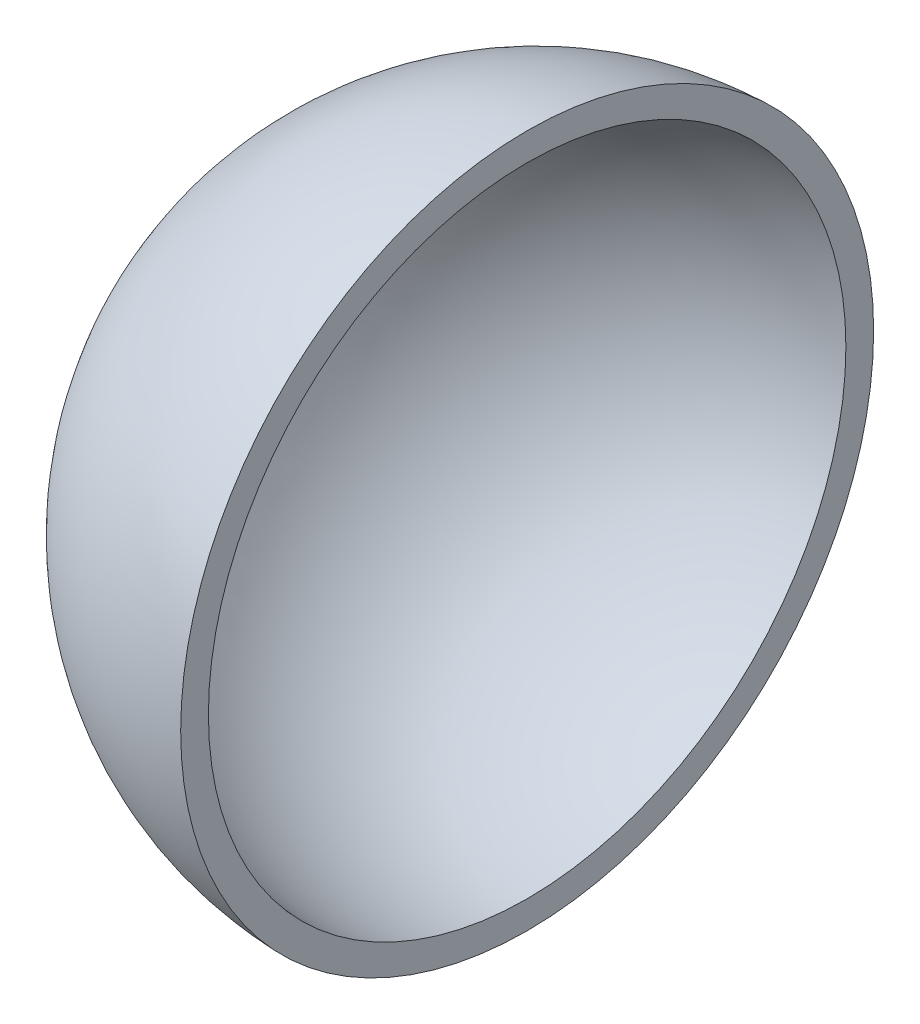
ISO-10303-21;
HEADER;
FILE_DESCRIPTION(('STEP AP214'),'2;1');
FILE_NAME('part.step','',(''),(''),'','','');
FILE_SCHEMA(('AUTOMOTIVE_DESIGN { 1 0 10303 214 1 1 1 1 }'));
ENDSEC;
DATA;
#1=APPLICATION_CONTEXT('core data for automotive mechanical design processes');
#2=APPLICATION_PROTOCOL_DEFINITION('international standard','automotive_design',2000,#1);
#3=PRODUCT_CONTEXT('',#1,'mechanical');
#4=PRODUCT('Part','Part','',(#3));
#5=PRODUCT_RELATED_PRODUCT_CATEGORY('part','',(#4));
#6=PRODUCT_DEFINITION_FORMATION('','',#4);
#7=PRODUCT_DEFINITION_CONTEXT('part definition',#1,'design');
#8=PRODUCT_DEFINITION('design','',#6,#7);
#9=PRODUCT_DEFINITION_SHAPE('','',#8);
#10=(LENGTH_UNIT() NAMED_UNIT(*) SI_UNIT(.MILLI.,.METRE.));
#11=(NAMED_UNIT(*) PLANE_ANGLE_UNIT() SI_UNIT($,.RADIAN.));
#12=(NAMED_UNIT(*) SI_UNIT($,.STERADIAN.) SOLID_ANGLE_UNIT());
#13=UNCERTAINTY_MEASURE_WITH_UNIT(LENGTH_MEASURE(1.E-05),#10,'distance_accuracy_value','');
#14=(GEOMETRIC_REPRESENTATION_CONTEXT(3) GLOBAL_UNCERTAINTY_ASSIGNED_CONTEXT((#13)) GLOBAL_UNIT_ASSIGNED_CONTEXT((#10,
#11,#12)) REPRESENTATION_CONTEXT('',''));
#15=CARTESIAN_POINT('',(0.,0.,0.));
#16=DIRECTION('',(0.,0.,1.));
#17=DIRECTION('',(1.,0.,0.));
#18=AXIS2_PLACEMENT_3D('',#15,#16,#17);
#19=CARTESIAN_POINT('',(0.,0.,0.));
#20=DIRECTION('',(1.,0.,0.));
#21=DIRECTION('',(0.,0.,1.));
#22=AXIS2_PLACEMENT_3D('',#19,#20,#21);
#23=SPHERICAL_SURFACE('',#22,37.5);
#24=CARTESIAN_POINT('',(-0.999999999999994,0.,0.));
#25=DIRECTION('',(1.,0.,0.));
#26=DIRECTION('',(0.,0.,-1.));
#27=AXIS2_PLACEMENT_3D('',#24,#25,#26);
#28=CIRCLE('',#27,37.4866642954531);
#29=CARTESIAN_POINT('',(-0.999999999999994,0.,-37.4866642954531));
#30=VERTEX_POINT('',#29);
#31=EDGE_CURVE('E10',#30,#30,#28,.T.);
#32=ORIENTED_EDGE('',*,*,#31,.F.);
#33=EDGE_LOOP('',(#32));
#34=FACE_BOUND('',#33,.T.);
#35=ADVANCED_FACE('F33',(#34),#23,.T.);
#36=CARTESIAN_POINT('',(-0.999999999999994,0.,34.4855042010408));
#37=DIRECTION('',(-1.,0.,0.));
#38=DIRECTION('',(0.,0.,1.));
#39=AXIS2_PLACEMENT_3D('',#36,#37,#38);
#40=PLANE('',#39);
#41=CARTESIAN_POINT('',(-0.999999999999995,0.,0.));
#42=DIRECTION('',(1.,0.,0.));
#43=DIRECTION('',(0.,0.,-1.));
#44=AXIS2_PLACEMENT_3D('',#41,#42,#43);
#45=CIRCLE('',#44,34.4855042010408);
#46=CARTESIAN_POINT('',(-0.999999999999995,0.,-34.4855042010408));
#47=VERTEX_POINT('',#46);
#48=EDGE_CURVE('E39',#47,#47,#45,.T.);
#49=ORIENTED_EDGE('',*,*,#48,.F.);
#50=EDGE_LOOP('',(#49));
#51=FACE_BOUND('',#50,.T.);
#52=ORIENTED_EDGE('',*,*,#31,.T.);
#53=EDGE_LOOP('',(#52));
#54=FACE_BOUND('',#53,.T.);
#55=ADVANCED_FACE('F47',(#51,#54),#40,.F.);
#56=CARTESIAN_POINT('',(0.,0.,0.));
#57=DIRECTION('',(1.,0.,0.));
#58=DIRECTION('',(0.,0.,1.));
#59=AXIS2_PLACEMENT_3D('',#56,#57,#58);
#60=SPHERICAL_SURFACE('',#59,34.5);
#61=ORIENTED_EDGE('',*,*,#48,.T.);
#62=EDGE_LOOP('',(#61));
#63=FACE_BOUND('',#62,.T.);
#64=ADVANCED_FACE('F45',(#63),#60,.F.);
#65=CLOSED_SHELL('',(#35,#55,#64));
#66=MANIFOLD_SOLID_BREP('B2',#65);
#67=ADVANCED_BREP_SHAPE_REPRESENTATION('',(#18,#66),#14);
#68=SHAPE_DEFINITION_REPRESENTATION(#9,#67);
ENDSEC;
END-ISO-10303-21;
